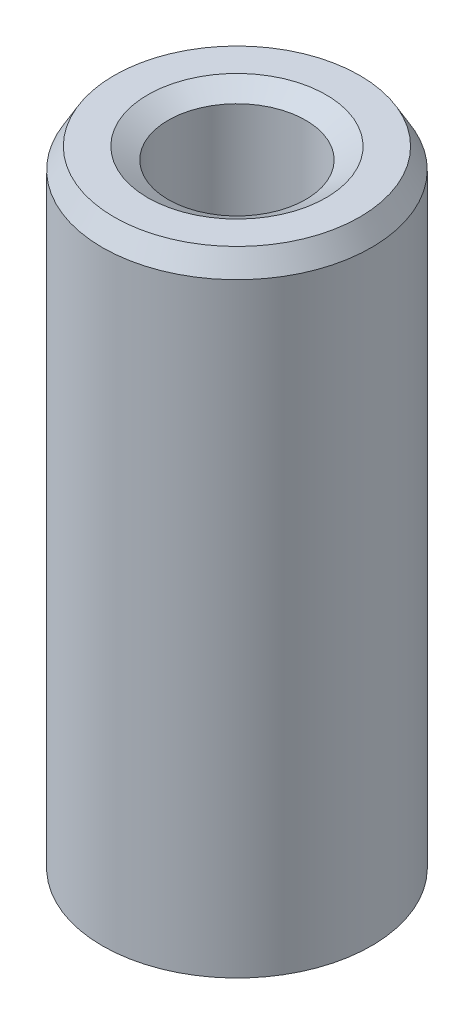
ISO-10303-21;
HEADER;
FILE_DESCRIPTION(('STEP AP214'),'2;1');
FILE_NAME('part.step','',(''),(''),'','','');
FILE_SCHEMA(('AUTOMOTIVE_DESIGN { 1 0 10303 214 1 1 1 1 }'));
ENDSEC;
DATA;
#1=APPLICATION_CONTEXT('core data for automotive mechanical design processes');
#2=APPLICATION_PROTOCOL_DEFINITION('international standard','automotive_design',2000,#1);
#3=PRODUCT_CONTEXT('',#1,'mechanical');
#4=PRODUCT('Part','Part','',(#3));
#5=PRODUCT_RELATED_PRODUCT_CATEGORY('part','',(#4));
#6=PRODUCT_DEFINITION_FORMATION('','',#4);
#7=PRODUCT_DEFINITION_CONTEXT('part definition',#1,'design');
#8=PRODUCT_DEFINITION('design','',#6,#7);
#9=PRODUCT_DEFINITION_SHAPE('','',#8);
#10=(LENGTH_UNIT() NAMED_UNIT(*) SI_UNIT(.MILLI.,.METRE.));
#11=(NAMED_UNIT(*) PLANE_ANGLE_UNIT() SI_UNIT($,.RADIAN.));
#12=(NAMED_UNIT(*) SI_UNIT($,.STERADIAN.) SOLID_ANGLE_UNIT());
#13=UNCERTAINTY_MEASURE_WITH_UNIT(LENGTH_MEASURE(1.E-05),#10,'distance_accuracy_value','');
#14=(GEOMETRIC_REPRESENTATION_CONTEXT(3) GLOBAL_UNCERTAINTY_ASSIGNED_CONTEXT((#13)) GLOBAL_UNIT_ASSIGNED_CONTEXT((#10,
#11,#12)) REPRESENTATION_CONTEXT('',''));
#15=CARTESIAN_POINT('',(0.,0.,0.));
#16=DIRECTION('',(0.,0.,1.));
#17=DIRECTION('',(1.,0.,0.));
#18=AXIS2_PLACEMENT_3D('',#15,#16,#17);
#19=CARTESIAN_POINT('',(0.,35.5000917907081,0.));
#20=DIRECTION('',(0.,-1.,0.));
#21=DIRECTION('',(0.,0.,-1.));
#22=AXIS2_PLACEMENT_3D('',#19,#20,#21);
#23=CYLINDRICAL_SURFACE('',#22,7.5);
#24=CARTESIAN_POINT('',(0.,0.65776334465803,0.));
#25=DIRECTION('',(0.,1.,0.));
#26=DIRECTION('',(0.,0.,1.));
#27=AXIS2_PLACEMENT_3D('',#24,#25,#26);
#28=CIRCLE('',#27,7.5);
#29=CARTESIAN_POINT('',(0.,0.65776334465803,7.5));
#30=VERTEX_POINT('',#29);
#31=EDGE_CURVE('E10',#30,#30,#28,.T.);
#32=ORIENTED_EDGE('',*,*,#31,.T.);
#33=EDGE_LOOP('',(#32));
#34=FACE_BOUND('',#33,.T.);
#35=CARTESIAN_POINT('',(0.,34.360812258404,0.));
#36=DIRECTION('',(0.,1.,0.));
#37=DIRECTION('',(0.,0.,1.));
#38=AXIS2_PLACEMENT_3D('',#35,#36,#37);
#39=CIRCLE('',#38,7.5);
#40=CARTESIAN_POINT('',(0.,34.360812258404,7.5));
#41=VERTEX_POINT('',#40);
#42=EDGE_CURVE('E50',#41,#41,#39,.F.);
#43=ORIENTED_EDGE('',*,*,#42,.T.);
#44=EDGE_LOOP('',(#43));
#45=FACE_BOUND('',#44,.T.);
#46=ADVANCED_FACE('F39',(#34,#45),#23,.T.);
#47=CARTESIAN_POINT('',(0.,35.5000917907081,0.));
#48=DIRECTION('',(0.,1.,0.));
#49=DIRECTION('',(0.,0.,1.));
#50=AXIS2_PLACEMENT_3D('',#47,#48,#49);
#51=PLANE('',#50);
#52=CARTESIAN_POINT('',(0.,35.5000917907081,0.));
#53=DIRECTION('',(0.,1.,0.));
#54=DIRECTION('',(0.,0.,1.));
#55=AXIS2_PLACEMENT_3D('',#52,#53,#54);
#56=CIRCLE('',#55,4.97119117210287);
#57=CARTESIAN_POINT('',(0.,35.5000917907081,4.97119117210287));
#58=VERTEX_POINT('',#57);
#59=EDGE_CURVE('E58',#58,#58,#56,.F.);
#60=ORIENTED_EDGE('',*,*,#59,.T.);
#61=EDGE_LOOP('',(#60));
#62=FACE_BOUND('',#61,.T.);
#63=CARTESIAN_POINT('',(0.,35.5000917907081,0.));
#64=DIRECTION('',(0.,1.,0.));
#65=DIRECTION('',(0.,0.,1.));
#66=AXIS2_PLACEMENT_3D('',#63,#64,#65);
#67=CIRCLE('',#66,6.84223665534197);
#68=CARTESIAN_POINT('',(0.,35.5000917907081,6.84223665534197));
#69=VERTEX_POINT('',#68);
#70=EDGE_CURVE('E61',#69,#69,#67,.T.);
#71=ORIENTED_EDGE('',*,*,#70,.T.);
#72=EDGE_LOOP('',(#71));
#73=FACE_BOUND('',#72,.T.);
#74=ADVANCED_FACE('F88',(#62,#73),#51,.T.);
#75=CARTESIAN_POINT('',(0.,0.,0.));
#76=DIRECTION('',(0.,1.,0.));
#77=DIRECTION('',(0.,0.,1.));
#78=AXIS2_PLACEMENT_3D('',#75,#76,#77);
#79=PLANE('',#78);
#80=CARTESIAN_POINT('',(0.,0.,0.));
#81=DIRECTION('',(0.,1.,0.));
#82=DIRECTION('',(0.,0.,1.));
#83=AXIS2_PLACEMENT_3D('',#80,#81,#82);
#84=CIRCLE('',#83,4.48967498445674);
#85=CARTESIAN_POINT('',(0.,0.,4.48967498445674));
#86=VERTEX_POINT('',#85);
#87=EDGE_CURVE('E51',#86,#86,#84,.T.);
#88=ORIENTED_EDGE('',*,*,#87,.T.);
#89=EDGE_LOOP('',(#88));
#90=FACE_BOUND('',#89,.T.);
#91=CARTESIAN_POINT('',(0.,0.,0.));
#92=DIRECTION('',(0.,1.,0.));
#93=DIRECTION('',(0.,0.,1.));
#94=AXIS2_PLACEMENT_3D('',#91,#92,#93);
#95=CIRCLE('',#94,6.36072046769584);
#96=CARTESIAN_POINT('',(0.,0.,6.36072046769584));
#97=VERTEX_POINT('',#96);
#98=EDGE_CURVE('E54',#97,#97,#95,.F.);
#99=ORIENTED_EDGE('',*,*,#98,.T.);
#100=EDGE_LOOP('',(#99));
#101=FACE_BOUND('',#100,.T.);
#102=ADVANCED_FACE('F83',(#90,#101),#79,.F.);
#103=CARTESIAN_POINT('',(0.,35.5000917907081,0.));
#104=DIRECTION('',(0.,-1.,0.));
#105=DIRECTION('',(0.,0.,-1.));
#106=AXIS2_PLACEMENT_3D('',#103,#104,#105);
#107=CYLINDRICAL_SURFACE('',#106,3.8319116397987);
#108=CARTESIAN_POINT('',(0.,34.8423284460501,0.));
#109=DIRECTION('',(0.,1.,0.));
#110=DIRECTION('',(0.,0.,1.));
#111=AXIS2_PLACEMENT_3D('',#108,#109,#110);
#112=CIRCLE('',#111,3.8319116397987);
#113=CARTESIAN_POINT('',(0.,34.8423284460501,3.8319116397987));
#114=VERTEX_POINT('',#113);
#115=EDGE_CURVE('E67',#114,#114,#112,.T.);
#116=ORIENTED_EDGE('',*,*,#115,.T.);
#117=EDGE_LOOP('',(#116));
#118=FACE_BOUND('',#117,.T.);
#119=CARTESIAN_POINT('',(0.,1.13927953230417,0.));
#120=DIRECTION('',(0.,1.,0.));
#121=DIRECTION('',(0.,0.,1.));
#122=AXIS2_PLACEMENT_3D('',#119,#120,#121);
#123=CIRCLE('',#122,3.8319116397987);
#124=CARTESIAN_POINT('',(0.,1.13927953230417,3.8319116397987));
#125=VERTEX_POINT('',#124);
#126=EDGE_CURVE('E69',#125,#125,#123,.F.);
#127=ORIENTED_EDGE('',*,*,#126,.T.);
#128=EDGE_LOOP('',(#127));
#129=FACE_BOUND('',#128,.T.);
#130=ADVANCED_FACE('F71',(#118,#129),#107,.F.);
#131=CARTESIAN_POINT('',(0.,34.8423284460501,0.));
#132=DIRECTION('',(0.,1.,0.));
#133=DIRECTION('',(0.,0.,1.));
#134=AXIS2_PLACEMENT_3D('',#131,#132,#133);
#135=CONICAL_SURFACE('',#134,3.8319116397987,1.04719755119661);
#136=ORIENTED_EDGE('',*,*,#59,.F.);
#137=EDGE_LOOP('',(#136));
#138=FACE_BOUND('',#137,.T.);
#139=ORIENTED_EDGE('',*,*,#115,.F.);
#140=EDGE_LOOP('',(#139));
#141=FACE_BOUND('',#140,.T.);
#142=ADVANCED_FACE('F77',(#138,#141),#135,.F.);
#143=CARTESIAN_POINT('',(0.,0.,0.));
#144=DIRECTION('',(0.,-1.,0.));
#145=DIRECTION('',(0.,0.,-1.));
#146=AXIS2_PLACEMENT_3D('',#143,#144,#145);
#147=CONICAL_SURFACE('',#146,4.48967498445674,0.523598775598295);
#148=ORIENTED_EDGE('',*,*,#126,.F.);
#149=EDGE_LOOP('',(#148));
#150=FACE_BOUND('',#149,.T.);
#151=ORIENTED_EDGE('',*,*,#87,.F.);
#152=EDGE_LOOP('',(#151));
#153=FACE_BOUND('',#152,.T.);
#154=ADVANCED_FACE('F73',(#150,#153),#147,.F.);
#155=CARTESIAN_POINT('',(0.,0.65776334465803,0.));
#156=DIRECTION('',(0.,1.,0.));
#157=DIRECTION('',(0.,0.,1.));
#158=AXIS2_PLACEMENT_3D('',#155,#156,#157);
#159=CONICAL_SURFACE('',#158,7.5,1.0471975511966);
#160=ORIENTED_EDGE('',*,*,#98,.F.);
#161=EDGE_LOOP('',(#160));
#162=FACE_BOUND('',#161,.T.);
#163=ORIENTED_EDGE('',*,*,#31,.F.);
#164=EDGE_LOOP('',(#163));
#165=FACE_BOUND('',#164,.T.);
#166=ADVANCED_FACE('F76',(#162,#165),#159,.T.);
#167=CARTESIAN_POINT('',(0.,35.5000917907081,0.));
#168=DIRECTION('',(0.,-1.,0.));
#169=DIRECTION('',(0.,0.,-1.));
#170=AXIS2_PLACEMENT_3D('',#167,#168,#169);
#171=CONICAL_SURFACE('',#170,6.84223665534197,0.523598775598294);
#172=ORIENTED_EDGE('',*,*,#42,.F.);
#173=EDGE_LOOP('',(#172));
#174=FACE_BOUND('',#173,.T.);
#175=ORIENTED_EDGE('',*,*,#70,.F.);
#176=EDGE_LOOP('',(#175));
#177=FACE_BOUND('',#176,.T.);
#178=ADVANCED_FACE('F45',(#174,#177),#171,.T.);
#179=CLOSED_SHELL('',(#46,#74,#102,#130,#142,#154,#166,#178));
#180=MANIFOLD_SOLID_BREP('B2',#179);
#181=ADVANCED_BREP_SHAPE_REPRESENTATION('',(#18,#180),#14);
#182=SHAPE_DEFINITION_REPRESENTATION(#9,#181);
ENDSEC;
END-ISO-10303-21;
